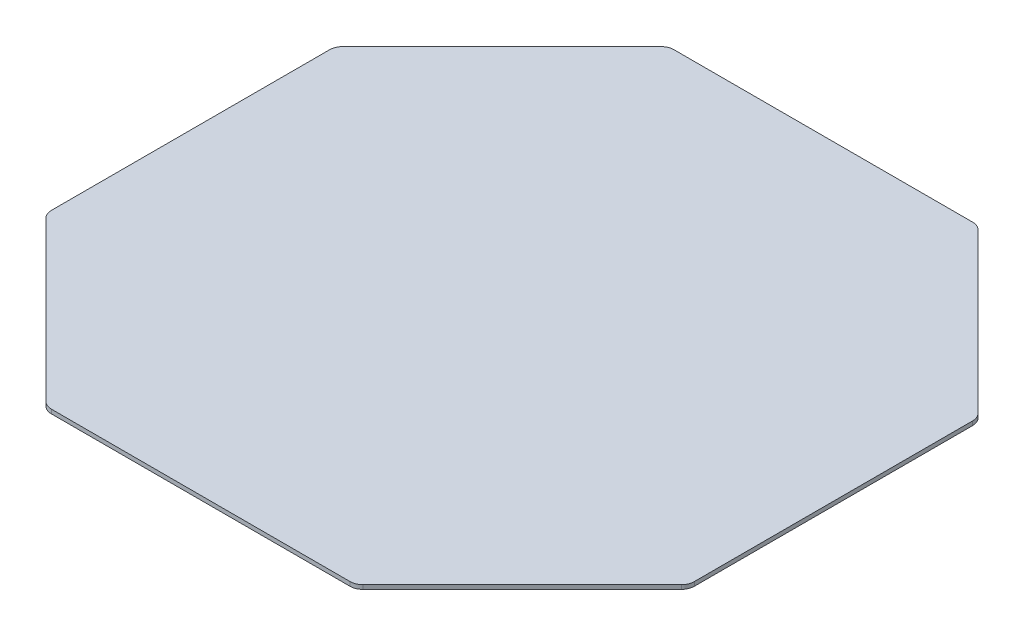
ISO-10303-21;
HEADER;
FILE_DESCRIPTION(('STEP AP214'),'2;1');
FILE_NAME('part.step','',(''),(''),'','','');
FILE_SCHEMA(('AUTOMOTIVE_DESIGN { 1 0 10303 214 1 1 1 1 }'));
ENDSEC;
DATA;
#1=APPLICATION_CONTEXT('core data for automotive mechanical design processes');
#2=APPLICATION_PROTOCOL_DEFINITION('international standard','automotive_design',2000,#1);
#3=PRODUCT_CONTEXT('',#1,'mechanical');
#4=PRODUCT('Part','Part','',(#3));
#5=PRODUCT_RELATED_PRODUCT_CATEGORY('part','',(#4));
#6=PRODUCT_DEFINITION_FORMATION('','',#4);
#7=PRODUCT_DEFINITION_CONTEXT('part definition',#1,'design');
#8=PRODUCT_DEFINITION('design','',#6,#7);
#9=PRODUCT_DEFINITION_SHAPE('','',#8);
#10=(LENGTH_UNIT() NAMED_UNIT(*) SI_UNIT(.MILLI.,.METRE.));
#11=(NAMED_UNIT(*) PLANE_ANGLE_UNIT() SI_UNIT($,.RADIAN.));
#12=(NAMED_UNIT(*) SI_UNIT($,.STERADIAN.) SOLID_ANGLE_UNIT());
#13=UNCERTAINTY_MEASURE_WITH_UNIT(LENGTH_MEASURE(1.E-05),#10,'distance_accuracy_value','');
#14=(GEOMETRIC_REPRESENTATION_CONTEXT(3) GLOBAL_UNCERTAINTY_ASSIGNED_CONTEXT((#13)) GLOBAL_UNIT_ASSIGNED_CONTEXT((#10,
#11,#12)) REPRESENTATION_CONTEXT('',''));
#15=CARTESIAN_POINT('',(0.,0.,0.));
#16=DIRECTION('',(0.,0.,1.));
#17=DIRECTION('',(1.,0.,0.));
#18=AXIS2_PLACEMENT_3D('',#15,#16,#17);
#19=CARTESIAN_POINT('',(30.5761429766666,0.8128,-61.5173390593272));
#20=DIRECTION('',(0.,0.,1.));
#21=DIRECTION('',(1.,0.,0.));
#22=AXIS2_PLACEMENT_3D('',#19,#20,#21);
#23=PLANE('',#22);
#24=DIRECTION('',(-1.,0.,0.));
#25=VECTOR('',#24,1.);
#26=CARTESIAN_POINT('',(30.5761429766666,0.,-61.5173390593272));
#27=LINE('',#26,#25);
#28=CARTESIAN_POINT('',(29.5240405282389,0.,-61.5173390593272));
#29=VERTEX_POINT('',#28);
#30=CARTESIAN_POINT('',(-29.5240405282388,0.,-61.5173390593272));
#31=VERTEX_POINT('',#30);
#32=EDGE_CURVE('E270',#29,#31,#27,.T.);
#33=ORIENTED_EDGE('',*,*,#32,.T.);
#34=DIRECTION('',(0.,-1.,0.));
#35=VECTOR('',#34,1.);
#36=CARTESIAN_POINT('',(-29.5240405282388,0.8128,-61.5173390593272));
#37=LINE('',#36,#35);
#38=CARTESIAN_POINT('',(-29.5240405282388,0.8128,-61.5173390593272));
#39=VERTEX_POINT('',#38);
#40=EDGE_CURVE('E233',#31,#39,#37,.F.);
#41=ORIENTED_EDGE('',*,*,#40,.T.);
#42=DIRECTION('',(-1.,0.,0.));
#43=VECTOR('',#42,1.);
#44=CARTESIAN_POINT('',(30.5761429766666,0.8128,-61.5173390593272));
#45=LINE('',#44,#43);
#46=CARTESIAN_POINT('',(29.5240405282389,0.8128,-61.5173390593272));
#47=VERTEX_POINT('',#46);
#48=EDGE_CURVE('E187',#47,#39,#45,.T.);
#49=ORIENTED_EDGE('',*,*,#48,.F.);
#50=DIRECTION('',(0.,-1.,0.));
#51=VECTOR('',#50,1.);
#52=CARTESIAN_POINT('',(29.5240405282389,0.8128,-61.5173390593272));
#53=LINE('',#52,#51);
#54=EDGE_CURVE('E230',#47,#29,#53,.T.);
#55=ORIENTED_EDGE('',*,*,#54,.T.);
#56=EDGE_LOOP('',(#33,#41,#49,#55));
#57=FACE_BOUND('',#56,.T.);
#58=ADVANCED_FACE('F30',(#57),#23,.F.);
#59=CARTESIAN_POINT('',(-30.5761429766665,0.8128,-61.5173390593272));
#60=DIRECTION('',(0.707106781186543,0.,0.707106781186552));
#61=DIRECTION('',(0.707106781186552,0.,-0.707106781186543));
#62=AXIS2_PLACEMENT_3D('',#59,#60,#61);
#63=PLANE('',#62);
#64=DIRECTION('',(-0.707106781186552,0.,0.707106781186543));
#65=VECTOR('',#64,1.);
#66=CARTESIAN_POINT('',(-30.5761429766665,0.,-61.5173390593272));
#67=LINE('',#66,#65);
#68=CARTESIAN_POINT('',(-31.3200917524526,0.,-60.773390283541));
#69=VERTEX_POINT('',#68);
#70=CARTESIAN_POINT('',(-62.7863902835414,0.,-29.3070917524527));
#71=VERTEX_POINT('',#70);
#72=EDGE_CURVE('E176',#69,#71,#67,.T.);
#73=ORIENTED_EDGE('',*,*,#72,.T.);
#74=DIRECTION('',(0.,-1.,0.));
#75=VECTOR('',#74,1.);
#76=CARTESIAN_POINT('',(-62.7863902835414,0.8128,-29.3070917524527));
#77=LINE('',#76,#75);
#78=CARTESIAN_POINT('',(-62.7863902835414,0.8128,-29.3070917524527));
#79=VERTEX_POINT('',#78);
#80=EDGE_CURVE('E228',#71,#79,#77,.F.);
#81=ORIENTED_EDGE('',*,*,#80,.T.);
#82=DIRECTION('',(-0.707106781186552,0.,0.707106781186543));
#83=VECTOR('',#82,1.);
#84=CARTESIAN_POINT('',(-30.5761429766665,0.8128,-61.5173390593272));
#85=LINE('',#84,#83);
#86=CARTESIAN_POINT('',(-31.3200917524526,0.8128,-60.773390283541));
#87=VERTEX_POINT('',#86);
#88=EDGE_CURVE('E288',#87,#79,#85,.T.);
#89=ORIENTED_EDGE('',*,*,#88,.F.);
#90=DIRECTION('',(0.,-1.,0.));
#91=VECTOR('',#90,1.);
#92=CARTESIAN_POINT('',(-31.3200917524526,0.8128,-60.773390283541));
#93=LINE('',#92,#91);
#94=EDGE_CURVE('E225',#87,#69,#93,.T.);
#95=ORIENTED_EDGE('',*,*,#94,.T.);
#96=EDGE_LOOP('',(#73,#81,#89,#95));
#97=FACE_BOUND('',#96,.T.);
#98=ADVANCED_FACE('F276',(#97),#63,.F.);
#99=CARTESIAN_POINT('',(-63.5303390593276,0.8128,-28.5631429766665));
#100=DIRECTION('',(1.,0.,0.));
#101=DIRECTION('',(0.,0.,-1.));
#102=AXIS2_PLACEMENT_3D('',#99,#100,#101);
#103=PLANE('',#102);
#104=DIRECTION('',(0.,0.,1.));
#105=VECTOR('',#104,1.);
#106=CARTESIAN_POINT('',(-63.5303390593276,0.,-28.5631429766665));
#107=LINE('',#106,#105);
#108=CARTESIAN_POINT('',(-63.5303390593276,0.,-27.5110405282389));
#109=VERTEX_POINT('',#108);
#110=CARTESIAN_POINT('',(-63.5303390593276,0.,27.5110405282388));
#111=VERTEX_POINT('',#110);
#112=EDGE_CURVE('E171',#109,#111,#107,.T.);
#113=ORIENTED_EDGE('',*,*,#112,.T.);
#114=DIRECTION('',(0.,-1.,0.));
#115=VECTOR('',#114,1.);
#116=CARTESIAN_POINT('',(-63.5303390593276,0.8128,27.5110405282388));
#117=LINE('',#116,#115);
#118=CARTESIAN_POINT('',(-63.5303390593276,0.8128,27.5110405282388));
#119=VERTEX_POINT('',#118);
#120=EDGE_CURVE('E149',#111,#119,#117,.F.);
#121=ORIENTED_EDGE('',*,*,#120,.T.);
#122=DIRECTION('',(0.,0.,1.));
#123=VECTOR('',#122,1.);
#124=CARTESIAN_POINT('',(-63.5303390593276,0.8128,-28.5631429766665));
#125=LINE('',#124,#123);
#126=CARTESIAN_POINT('',(-63.5303390593276,0.8128,-27.5110405282389));
#127=VERTEX_POINT('',#126);
#128=EDGE_CURVE('E287',#127,#119,#125,.T.);
#129=ORIENTED_EDGE('',*,*,#128,.F.);
#130=DIRECTION('',(0.,-1.,0.));
#131=VECTOR('',#130,1.);
#132=CARTESIAN_POINT('',(-63.5303390593276,0.8128,-27.5110405282389));
#133=LINE('',#132,#131);
#134=EDGE_CURVE('E154',#127,#109,#133,.T.);
#135=ORIENTED_EDGE('',*,*,#134,.T.);
#136=EDGE_LOOP('',(#113,#121,#129,#135));
#137=FACE_BOUND('',#136,.T.);
#138=ADVANCED_FACE('F290',(#137),#103,.F.);
#139=CARTESIAN_POINT('',(-30.5761429766665,0.8128,61.5173390593272));
#140=DIRECTION('',(0.707106781186544,0.,-0.707106781186552));
#141=DIRECTION('',(-0.707106781186551,0.,-0.707106781186544));
#142=AXIS2_PLACEMENT_3D('',#139,#140,#141);
#143=PLANE('',#142);
#144=DIRECTION('',(0.707106781186551,0.,0.707106781186544));
#145=VECTOR('',#144,1.);
#146=CARTESIAN_POINT('',(-30.5761429766665,0.8128,61.5173390593272));
#147=LINE('',#146,#145);
#148=CARTESIAN_POINT('',(-62.7863902835414,0.8128,29.3070917524527));
#149=VERTEX_POINT('',#148);
#150=CARTESIAN_POINT('',(-31.3200917524527,0.8128,60.773390283541));
#151=VERTEX_POINT('',#150);
#152=EDGE_CURVE('E164',#149,#151,#147,.T.);
#153=ORIENTED_EDGE('',*,*,#152,.F.);
#154=DIRECTION('',(0.,-1.,0.));
#155=VECTOR('',#154,1.);
#156=CARTESIAN_POINT('',(-62.7863902835414,0.8128,29.3070917524527));
#157=LINE('',#156,#155);
#158=CARTESIAN_POINT('',(-62.7863902835414,0.,29.3070917524527));
#159=VERTEX_POINT('',#158);
#160=EDGE_CURVE('E148',#149,#159,#157,.T.);
#161=ORIENTED_EDGE('',*,*,#160,.T.);
#162=DIRECTION('',(0.707106781186551,0.,0.707106781186544));
#163=VECTOR('',#162,1.);
#164=CARTESIAN_POINT('',(-30.5761429766665,0.,61.5173390593272));
#165=LINE('',#164,#163);
#166=CARTESIAN_POINT('',(-31.3200917524527,0.,60.773390283541));
#167=VERTEX_POINT('',#166);
#168=EDGE_CURVE('E161',#159,#167,#165,.T.);
#169=ORIENTED_EDGE('',*,*,#168,.T.);
#170=DIRECTION('',(0.,-1.,0.));
#171=VECTOR('',#170,1.);
#172=CARTESIAN_POINT('',(-31.3200917524527,0.8128,60.773390283541));
#173=LINE('',#172,#171);
#174=EDGE_CURVE('E166',#167,#151,#173,.F.);
#175=ORIENTED_EDGE('',*,*,#174,.T.);
#176=EDGE_LOOP('',(#153,#161,#169,#175));
#177=FACE_BOUND('',#176,.T.);
#178=ADVANCED_FACE('F160',(#177),#143,.F.);
#179=CARTESIAN_POINT('',(30.5761429766666,0.8128,61.5173390593272));
#180=DIRECTION('',(0.,0.,-1.));
#181=DIRECTION('',(-1.,0.,0.));
#182=AXIS2_PLACEMENT_3D('',#179,#180,#181);
#183=PLANE('',#182);
#184=DIRECTION('',(1.,0.,0.));
#185=VECTOR('',#184,1.);
#186=CARTESIAN_POINT('',(30.5761429766666,0.8128,61.5173390593272));
#187=LINE('',#186,#185);
#188=CARTESIAN_POINT('',(-29.5240405282389,0.8128,61.5173390593272));
#189=VERTEX_POINT('',#188);
#190=CARTESIAN_POINT('',(29.5240405282389,0.8128,61.5173390593272));
#191=VERTEX_POINT('',#190);
#192=EDGE_CURVE('E266',#189,#191,#187,.T.);
#193=ORIENTED_EDGE('',*,*,#192,.F.);
#194=DIRECTION('',(0.,-1.,0.));
#195=VECTOR('',#194,1.);
#196=CARTESIAN_POINT('',(-29.5240405282389,0.8128,61.5173390593272));
#197=LINE('',#196,#195);
#198=CARTESIAN_POINT('',(-29.5240405282389,0.,61.5173390593272));
#199=VERTEX_POINT('',#198);
#200=EDGE_CURVE('E222',#189,#199,#197,.T.);
#201=ORIENTED_EDGE('',*,*,#200,.T.);
#202=DIRECTION('',(1.,0.,0.));
#203=VECTOR('',#202,1.);
#204=CARTESIAN_POINT('',(30.5761429766666,0.,61.5173390593272));
#205=LINE('',#204,#203);
#206=CARTESIAN_POINT('',(29.5240405282389,0.,61.5173390593272));
#207=VERTEX_POINT('',#206);
#208=EDGE_CURVE('E170',#199,#207,#205,.T.);
#209=ORIENTED_EDGE('',*,*,#208,.T.);
#210=DIRECTION('',(0.,-1.,0.));
#211=VECTOR('',#210,1.);
#212=CARTESIAN_POINT('',(29.5240405282389,0.8128,61.5173390593272));
#213=LINE('',#212,#211);
#214=EDGE_CURVE('E220',#207,#191,#213,.F.);
#215=ORIENTED_EDGE('',*,*,#214,.T.);
#216=EDGE_LOOP('',(#193,#201,#209,#215));
#217=FACE_BOUND('',#216,.T.);
#218=ADVANCED_FACE('F301',(#217),#183,.F.);
#219=CARTESIAN_POINT('',(30.5761429766666,0.8128,61.5173390593272));
#220=DIRECTION('',(-0.707106781186544,0.,-0.707106781186551));
#221=DIRECTION('',(-0.707106781186551,0.,0.707106781186544));
#222=AXIS2_PLACEMENT_3D('',#219,#220,#221);
#223=PLANE('',#222);
#224=DIRECTION('',(0.707106781186551,0.,-0.707106781186544));
#225=VECTOR('',#224,1.);
#226=CARTESIAN_POINT('',(30.5761429766666,0.,61.5173390593272));
#227=LINE('',#226,#225);
#228=CARTESIAN_POINT('',(31.3200917524528,0.,60.773390283541));
#229=VERTEX_POINT('',#228);
#230=CARTESIAN_POINT('',(62.7863902835414,0.,29.3070917524527));
#231=VERTEX_POINT('',#230);
#232=EDGE_CURVE('E174',#229,#231,#227,.T.);
#233=ORIENTED_EDGE('',*,*,#232,.T.);
#234=DIRECTION('',(0.,-1.,0.));
#235=VECTOR('',#234,1.);
#236=CARTESIAN_POINT('',(62.7863902835414,0.8128,29.3070917524527));
#237=LINE('',#236,#235);
#238=CARTESIAN_POINT('',(62.7863902835414,0.8128,29.3070917524527));
#239=VERTEX_POINT('',#238);
#240=EDGE_CURVE('E11',#231,#239,#237,.F.);
#241=ORIENTED_EDGE('',*,*,#240,.T.);
#242=DIRECTION('',(0.707106781186551,0.,-0.707106781186544));
#243=VECTOR('',#242,1.);
#244=CARTESIAN_POINT('',(30.5761429766666,0.8128,61.5173390593272));
#245=LINE('',#244,#243);
#246=CARTESIAN_POINT('',(31.3200917524528,0.8128,60.773390283541));
#247=VERTEX_POINT('',#246);
#248=EDGE_CURVE('E251',#247,#239,#245,.T.);
#249=ORIENTED_EDGE('',*,*,#248,.F.);
#250=DIRECTION('',(0.,-1.,0.));
#251=VECTOR('',#250,1.);
#252=CARTESIAN_POINT('',(31.3200917524528,0.8128,60.773390283541));
#253=LINE('',#252,#251);
#254=EDGE_CURVE('E38',#247,#229,#253,.T.);
#255=ORIENTED_EDGE('',*,*,#254,.T.);
#256=EDGE_LOOP('',(#233,#241,#249,#255));
#257=FACE_BOUND('',#256,.T.);
#258=ADVANCED_FACE('F248',(#257),#223,.F.);
#259=CARTESIAN_POINT('',(63.5303390593276,0.8128,-28.5631429766665));
#260=DIRECTION('',(-1.,0.,0.));
#261=DIRECTION('',(0.,0.,1.));
#262=AXIS2_PLACEMENT_3D('',#259,#260,#261);
#263=PLANE('',#262);
#264=DIRECTION('',(0.,0.,-1.));
#265=VECTOR('',#264,1.);
#266=CARTESIAN_POINT('',(63.5303390593276,0.,-28.5631429766665));
#267=LINE('',#266,#265);
#268=CARTESIAN_POINT('',(63.5303390593276,0.,27.5110405282388));
#269=VERTEX_POINT('',#268);
#270=CARTESIAN_POINT('',(63.5303390593276,0.,-27.5110405282389));
#271=VERTEX_POINT('',#270);
#272=EDGE_CURVE('E182',#269,#271,#267,.T.);
#273=ORIENTED_EDGE('',*,*,#272,.T.);
#274=DIRECTION('',(0.,-1.,0.));
#275=VECTOR('',#274,1.);
#276=CARTESIAN_POINT('',(63.5303390593276,0.8128,-27.5110405282389));
#277=LINE('',#276,#275);
#278=CARTESIAN_POINT('',(63.5303390593276,0.8128,-27.5110405282389));
#279=VERTEX_POINT('',#278);
#280=EDGE_CURVE('E242',#271,#279,#277,.F.);
#281=ORIENTED_EDGE('',*,*,#280,.T.);
#282=DIRECTION('',(0.,0.,-1.));
#283=VECTOR('',#282,1.);
#284=CARTESIAN_POINT('',(63.5303390593276,0.8128,-28.5631429766665));
#285=LINE('',#284,#283);
#286=CARTESIAN_POINT('',(63.5303390593276,0.8128,27.5110405282388));
#287=VERTEX_POINT('',#286);
#288=EDGE_CURVE('E263',#287,#279,#285,.T.);
#289=ORIENTED_EDGE('',*,*,#288,.F.);
#290=DIRECTION('',(0.,-1.,0.));
#291=VECTOR('',#290,1.);
#292=CARTESIAN_POINT('',(63.5303390593276,0.8128,27.5110405282388));
#293=LINE('',#292,#291);
#294=EDGE_CURVE('E239',#287,#269,#293,.T.);
#295=ORIENTED_EDGE('',*,*,#294,.T.);
#296=EDGE_LOOP('',(#273,#281,#289,#295));
#297=FACE_BOUND('',#296,.T.);
#298=ADVANCED_FACE('F261',(#297),#263,.F.);
#299=CARTESIAN_POINT('',(30.5761429766666,0.8128,-61.5173390593272));
#300=DIRECTION('',(-0.707106781186544,0.,0.707106781186551));
#301=DIRECTION('',(0.707106781186551,0.,0.707106781186544));
#302=AXIS2_PLACEMENT_3D('',#299,#300,#301);
#303=PLANE('',#302);
#304=DIRECTION('',(-0.707106781186551,0.,-0.707106781186544));
#305=VECTOR('',#304,1.);
#306=CARTESIAN_POINT('',(30.5761429766666,0.,-61.5173390593272));
#307=LINE('',#306,#305);
#308=CARTESIAN_POINT('',(62.7863902835414,0.,-29.3070917524527));
#309=VERTEX_POINT('',#308);
#310=CARTESIAN_POINT('',(31.3200917524527,0.,-60.773390283541));
#311=VERTEX_POINT('',#310);
#312=EDGE_CURVE('E185',#309,#311,#307,.T.);
#313=ORIENTED_EDGE('',*,*,#312,.T.);
#314=DIRECTION('',(0.,-1.,0.));
#315=VECTOR('',#314,1.);
#316=CARTESIAN_POINT('',(31.3200917524527,0.8128,-60.773390283541));
#317=LINE('',#316,#315);
#318=CARTESIAN_POINT('',(31.3200917524527,0.8128,-60.773390283541));
#319=VERTEX_POINT('',#318);
#320=EDGE_CURVE('E45',#311,#319,#317,.F.);
#321=ORIENTED_EDGE('',*,*,#320,.T.);
#322=DIRECTION('',(-0.707106781186551,0.,-0.707106781186544));
#323=VECTOR('',#322,1.);
#324=CARTESIAN_POINT('',(30.5761429766666,0.8128,-61.5173390593272));
#325=LINE('',#324,#323);
#326=CARTESIAN_POINT('',(62.7863902835414,0.8128,-29.3070917524527));
#327=VERTEX_POINT('',#326);
#328=EDGE_CURVE('E188',#327,#319,#325,.T.);
#329=ORIENTED_EDGE('',*,*,#328,.F.);
#330=DIRECTION('',(0.,-1.,0.));
#331=VECTOR('',#330,1.);
#332=CARTESIAN_POINT('',(62.7863902835414,0.8128,-29.3070917524527));
#333=LINE('',#332,#331);
#334=EDGE_CURVE('E235',#327,#309,#333,.T.);
#335=ORIENTED_EDGE('',*,*,#334,.T.);
#336=EDGE_LOOP('',(#313,#321,#329,#335));
#337=FACE_BOUND('',#336,.T.);
#338=ADVANCED_FACE('F331',(#337),#303,.F.);
#339=CARTESIAN_POINT('',(-63.5303390593276,0.8128,-61.5173390593272));
#340=DIRECTION('',(0.,1.,0.));
#341=DIRECTION('',(0.,0.,1.));
#342=AXIS2_PLACEMENT_3D('',#339,#340,#341);
#343=PLANE('',#342);
#344=ORIENTED_EDGE('',*,*,#128,.T.);
#345=CARTESIAN_POINT('',(-60.9903390593276,0.8128,27.5110405282388));
#346=DIRECTION('',(0.,1.,0.));
#347=DIRECTION('',(0.,0.,1.));
#348=AXIS2_PLACEMENT_3D('',#345,#346,#347);
#349=CIRCLE('',#348,2.54);
#350=EDGE_CURVE('E218',#119,#149,#349,.T.);
#351=ORIENTED_EDGE('',*,*,#350,.T.);
#352=ORIENTED_EDGE('',*,*,#152,.T.);
#353=CARTESIAN_POINT('',(-29.5240405282389,0.8128,58.9773390593272));
#354=DIRECTION('',(0.,1.,0.));
#355=DIRECTION('',(0.,0.,1.));
#356=AXIS2_PLACEMENT_3D('',#353,#354,#355);
#357=CIRCLE('',#356,2.54);
#358=EDGE_CURVE('E216',#151,#189,#357,.T.);
#359=ORIENTED_EDGE('',*,*,#358,.T.);
#360=ORIENTED_EDGE('',*,*,#192,.T.);
#361=CARTESIAN_POINT('',(29.5240405282389,0.8128,58.9773390593272));
#362=DIRECTION('',(0.,1.,0.));
#363=DIRECTION('',(0.,0.,1.));
#364=AXIS2_PLACEMENT_3D('',#361,#362,#363);
#365=CIRCLE('',#364,2.54);
#366=EDGE_CURVE('E205',#191,#247,#365,.T.);
#367=ORIENTED_EDGE('',*,*,#366,.T.);
#368=ORIENTED_EDGE('',*,*,#248,.T.);
#369=CARTESIAN_POINT('',(60.9903390593276,0.8128,27.5110405282388));
#370=DIRECTION('',(0.,1.,0.));
#371=DIRECTION('',(0.,0.,1.));
#372=AXIS2_PLACEMENT_3D('',#369,#370,#371);
#373=CIRCLE('',#372,2.54);
#374=EDGE_CURVE('E207',#239,#287,#373,.T.);
#375=ORIENTED_EDGE('',*,*,#374,.T.);
#376=ORIENTED_EDGE('',*,*,#288,.T.);
#377=CARTESIAN_POINT('',(60.9903390593276,0.8128,-27.5110405282389));
#378=DIRECTION('',(0.,1.,0.));
#379=DIRECTION('',(0.,0.,1.));
#380=AXIS2_PLACEMENT_3D('',#377,#378,#379);
#381=CIRCLE('',#380,2.54);
#382=EDGE_CURVE('E52',#279,#327,#381,.T.);
#383=ORIENTED_EDGE('',*,*,#382,.T.);
#384=ORIENTED_EDGE('',*,*,#328,.T.);
#385=CARTESIAN_POINT('',(29.5240405282389,0.8128,-58.9773390593272));
#386=DIRECTION('',(0.,1.,0.));
#387=DIRECTION('',(0.,0.,1.));
#388=AXIS2_PLACEMENT_3D('',#385,#386,#387);
#389=CIRCLE('',#388,2.54);
#390=EDGE_CURVE('E210',#319,#47,#389,.T.);
#391=ORIENTED_EDGE('',*,*,#390,.T.);
#392=ORIENTED_EDGE('',*,*,#48,.T.);
#393=CARTESIAN_POINT('',(-29.5240405282388,0.8128,-58.9773390593272));
#394=DIRECTION('',(0.,1.,0.));
#395=DIRECTION('',(0.,0.,1.));
#396=AXIS2_PLACEMENT_3D('',#393,#394,#395);
#397=CIRCLE('',#396,2.54);
#398=EDGE_CURVE('E212',#39,#87,#397,.T.);
#399=ORIENTED_EDGE('',*,*,#398,.T.);
#400=ORIENTED_EDGE('',*,*,#88,.T.);
#401=CARTESIAN_POINT('',(-60.9903390593276,0.8128,-27.5110405282389));
#402=DIRECTION('',(0.,1.,0.));
#403=DIRECTION('',(0.,0.,1.));
#404=AXIS2_PLACEMENT_3D('',#401,#402,#403);
#405=CIRCLE('',#404,2.54);
#406=EDGE_CURVE('E214',#79,#127,#405,.T.);
#407=ORIENTED_EDGE('',*,*,#406,.T.);
#408=EDGE_LOOP('',(#344,#351,#352,#359,#360,#367,#368,#375,#376,#383,#384,#391,#392,#399,#400,#407));
#409=FACE_BOUND('',#408,.T.);
#410=ADVANCED_FACE('F286',(#409),#343,.T.);
#411=CARTESIAN_POINT('',(-63.5303390593276,0.,-61.5173390593272));
#412=DIRECTION('',(0.,1.,0.));
#413=DIRECTION('',(0.,0.,1.));
#414=AXIS2_PLACEMENT_3D('',#411,#412,#413);
#415=PLANE('',#414);
#416=ORIENTED_EDGE('',*,*,#168,.F.);
#417=CARTESIAN_POINT('',(-60.9903390593276,0.,27.5110405282388));
#418=DIRECTION('',(0.,1.,0.));
#419=DIRECTION('',(0.,0.,1.));
#420=AXIS2_PLACEMENT_3D('',#417,#418,#419);
#421=CIRCLE('',#420,2.54);
#422=EDGE_CURVE('E144',#159,#111,#421,.F.);
#423=ORIENTED_EDGE('',*,*,#422,.T.);
#424=ORIENTED_EDGE('',*,*,#112,.F.);
#425=CARTESIAN_POINT('',(-60.9903390593276,0.,-27.5110405282389));
#426=DIRECTION('',(0.,1.,0.));
#427=DIRECTION('',(0.,0.,1.));
#428=AXIS2_PLACEMENT_3D('',#425,#426,#427);
#429=CIRCLE('',#428,2.54);
#430=EDGE_CURVE('E199',#109,#71,#429,.F.);
#431=ORIENTED_EDGE('',*,*,#430,.T.);
#432=ORIENTED_EDGE('',*,*,#72,.F.);
#433=CARTESIAN_POINT('',(-29.5240405282388,0.,-58.9773390593272));
#434=DIRECTION('',(0.,1.,0.));
#435=DIRECTION('',(0.,0.,1.));
#436=AXIS2_PLACEMENT_3D('',#433,#434,#435);
#437=CIRCLE('',#436,2.54);
#438=EDGE_CURVE('E197',#69,#31,#437,.F.);
#439=ORIENTED_EDGE('',*,*,#438,.T.);
#440=ORIENTED_EDGE('',*,*,#32,.F.);
#441=CARTESIAN_POINT('',(29.5240405282389,0.,-58.9773390593272));
#442=DIRECTION('',(0.,1.,0.));
#443=DIRECTION('',(0.,0.,1.));
#444=AXIS2_PLACEMENT_3D('',#441,#442,#443);
#445=CIRCLE('',#444,2.54);
#446=EDGE_CURVE('E195',#29,#311,#445,.F.);
#447=ORIENTED_EDGE('',*,*,#446,.T.);
#448=ORIENTED_EDGE('',*,*,#312,.F.);
#449=CARTESIAN_POINT('',(60.9903390593276,0.,-27.5110405282389));
#450=DIRECTION('',(0.,1.,0.));
#451=DIRECTION('',(0.,0.,1.));
#452=AXIS2_PLACEMENT_3D('',#449,#450,#451);
#453=CIRCLE('',#452,2.54);
#454=EDGE_CURVE('E193',#309,#271,#453,.F.);
#455=ORIENTED_EDGE('',*,*,#454,.T.);
#456=ORIENTED_EDGE('',*,*,#272,.F.);
#457=CARTESIAN_POINT('',(60.9903390593276,0.,27.5110405282388));
#458=DIRECTION('',(0.,1.,0.));
#459=DIRECTION('',(0.,0.,1.));
#460=AXIS2_PLACEMENT_3D('',#457,#458,#459);
#461=CIRCLE('',#460,2.54);
#462=EDGE_CURVE('E191',#269,#231,#461,.F.);
#463=ORIENTED_EDGE('',*,*,#462,.T.);
#464=ORIENTED_EDGE('',*,*,#232,.F.);
#465=CARTESIAN_POINT('',(29.5240405282389,0.,58.9773390593272));
#466=DIRECTION('',(0.,1.,0.));
#467=DIRECTION('',(0.,0.,1.));
#468=AXIS2_PLACEMENT_3D('',#465,#466,#467);
#469=CIRCLE('',#468,2.54);
#470=EDGE_CURVE('E165',#229,#207,#469,.F.);
#471=ORIENTED_EDGE('',*,*,#470,.T.);
#472=ORIENTED_EDGE('',*,*,#208,.F.);
#473=CARTESIAN_POINT('',(-29.5240405282389,0.,58.9773390593272));
#474=DIRECTION('',(0.,1.,0.));
#475=DIRECTION('',(0.,0.,1.));
#476=AXIS2_PLACEMENT_3D('',#473,#474,#475);
#477=CIRCLE('',#476,2.54);
#478=EDGE_CURVE('E155',#199,#167,#477,.F.);
#479=ORIENTED_EDGE('',*,*,#478,.T.);
#480=EDGE_LOOP('',(#416,#423,#424,#431,#432,#439,#440,#447,#448,#455,#456,#463,#464,#471,#472,#479));
#481=FACE_BOUND('',#480,.T.);
#482=ADVANCED_FACE('F168',(#481),#415,.F.);
#483=CARTESIAN_POINT('',(-60.9903390593276,0.8128,27.5110405282388));
#484=DIRECTION('',(0.,-1.,0.));
#485=DIRECTION('',(0.,0.,-1.));
#486=AXIS2_PLACEMENT_3D('',#483,#484,#485);
#487=CYLINDRICAL_SURFACE('',#486,2.54);
#488=ORIENTED_EDGE('',*,*,#350,.F.);
#489=ORIENTED_EDGE('',*,*,#120,.F.);
#490=ORIENTED_EDGE('',*,*,#422,.F.);
#491=ORIENTED_EDGE('',*,*,#160,.F.);
#492=EDGE_LOOP('',(#488,#489,#490,#491));
#493=FACE_BOUND('',#492,.T.);
#494=ADVANCED_FACE('F147',(#493),#487,.T.);
#495=CARTESIAN_POINT('',(-29.5240405282389,0.8128,58.9773390593272));
#496=DIRECTION('',(0.,-1.,0.));
#497=DIRECTION('',(0.,0.,-1.));
#498=AXIS2_PLACEMENT_3D('',#495,#496,#497);
#499=CYLINDRICAL_SURFACE('',#498,2.54);
#500=ORIENTED_EDGE('',*,*,#358,.F.);
#501=ORIENTED_EDGE('',*,*,#174,.F.);
#502=ORIENTED_EDGE('',*,*,#478,.F.);
#503=ORIENTED_EDGE('',*,*,#200,.F.);
#504=EDGE_LOOP('',(#500,#501,#502,#503));
#505=FACE_BOUND('',#504,.T.);
#506=ADVANCED_FACE('F303',(#505),#499,.T.);
#507=CARTESIAN_POINT('',(-60.9903390593276,0.8128,-27.5110405282389));
#508=DIRECTION('',(0.,-1.,0.));
#509=DIRECTION('',(0.,0.,-1.));
#510=AXIS2_PLACEMENT_3D('',#507,#508,#509);
#511=CYLINDRICAL_SURFACE('',#510,2.54);
#512=ORIENTED_EDGE('',*,*,#406,.F.);
#513=ORIENTED_EDGE('',*,*,#80,.F.);
#514=ORIENTED_EDGE('',*,*,#430,.F.);
#515=ORIENTED_EDGE('',*,*,#134,.F.);
#516=EDGE_LOOP('',(#512,#513,#514,#515));
#517=FACE_BOUND('',#516,.T.);
#518=ADVANCED_FACE('F282',(#517),#511,.T.);
#519=CARTESIAN_POINT('',(-29.5240405282388,0.8128,-58.9773390593272));
#520=DIRECTION('',(0.,-1.,0.));
#521=DIRECTION('',(0.,0.,-1.));
#522=AXIS2_PLACEMENT_3D('',#519,#520,#521);
#523=CYLINDRICAL_SURFACE('',#522,2.54);
#524=ORIENTED_EDGE('',*,*,#398,.F.);
#525=ORIENTED_EDGE('',*,*,#40,.F.);
#526=ORIENTED_EDGE('',*,*,#438,.F.);
#527=ORIENTED_EDGE('',*,*,#94,.F.);
#528=EDGE_LOOP('',(#524,#525,#526,#527));
#529=FACE_BOUND('',#528,.T.);
#530=ADVANCED_FACE('F310',(#529),#523,.T.);
#531=CARTESIAN_POINT('',(29.5240405282389,0.8128,-58.9773390593272));
#532=DIRECTION('',(0.,-1.,0.));
#533=DIRECTION('',(0.,0.,-1.));
#534=AXIS2_PLACEMENT_3D('',#531,#532,#533);
#535=CYLINDRICAL_SURFACE('',#534,2.54);
#536=ORIENTED_EDGE('',*,*,#390,.F.);
#537=ORIENTED_EDGE('',*,*,#320,.F.);
#538=ORIENTED_EDGE('',*,*,#446,.F.);
#539=ORIENTED_EDGE('',*,*,#54,.F.);
#540=EDGE_LOOP('',(#536,#537,#538,#539));
#541=FACE_BOUND('',#540,.T.);
#542=ADVANCED_FACE('F368',(#541),#535,.T.);
#543=CARTESIAN_POINT('',(60.9903390593276,0.8128,-27.5110405282389));
#544=DIRECTION('',(0.,-1.,0.));
#545=DIRECTION('',(0.,0.,-1.));
#546=AXIS2_PLACEMENT_3D('',#543,#544,#545);
#547=CYLINDRICAL_SURFACE('',#546,2.54);
#548=ORIENTED_EDGE('',*,*,#382,.F.);
#549=ORIENTED_EDGE('',*,*,#280,.F.);
#550=ORIENTED_EDGE('',*,*,#454,.F.);
#551=ORIENTED_EDGE('',*,*,#334,.F.);
#552=EDGE_LOOP('',(#548,#549,#550,#551));
#553=FACE_BOUND('',#552,.T.);
#554=ADVANCED_FACE('F378',(#553),#547,.T.);
#555=CARTESIAN_POINT('',(60.9903390593276,0.8128,27.5110405282388));
#556=DIRECTION('',(0.,-1.,0.));
#557=DIRECTION('',(0.,0.,-1.));
#558=AXIS2_PLACEMENT_3D('',#555,#556,#557);
#559=CYLINDRICAL_SURFACE('',#558,2.54);
#560=ORIENTED_EDGE('',*,*,#374,.F.);
#561=ORIENTED_EDGE('',*,*,#240,.F.);
#562=ORIENTED_EDGE('',*,*,#462,.F.);
#563=ORIENTED_EDGE('',*,*,#294,.F.);
#564=EDGE_LOOP('',(#560,#561,#562,#563));
#565=FACE_BOUND('',#564,.T.);
#566=ADVANCED_FACE('F258',(#565),#559,.T.);
#567=CARTESIAN_POINT('',(29.5240405282389,0.8128,58.9773390593272));
#568=DIRECTION('',(0.,-1.,0.));
#569=DIRECTION('',(0.,0.,-1.));
#570=AXIS2_PLACEMENT_3D('',#567,#568,#569);
#571=CYLINDRICAL_SURFACE('',#570,2.54);
#572=ORIENTED_EDGE('',*,*,#366,.F.);
#573=ORIENTED_EDGE('',*,*,#214,.F.);
#574=ORIENTED_EDGE('',*,*,#470,.F.);
#575=ORIENTED_EDGE('',*,*,#254,.F.);
#576=EDGE_LOOP('',(#572,#573,#574,#575));
#577=FACE_BOUND('',#576,.T.);
#578=ADVANCED_FACE('F32',(#577),#571,.T.);
#579=CLOSED_SHELL('',(#58,#98,#138,#178,#218,#258,#298,#338,#410,#482,#494,#506,#518,#530,#542,
#554,#566,#578));
#580=MANIFOLD_SOLID_BREP('B2',#579);
#581=ADVANCED_BREP_SHAPE_REPRESENTATION('',(#18,#580),#14);
#582=SHAPE_DEFINITION_REPRESENTATION(#9,#581);
ENDSEC;
END-ISO-10303-21;
